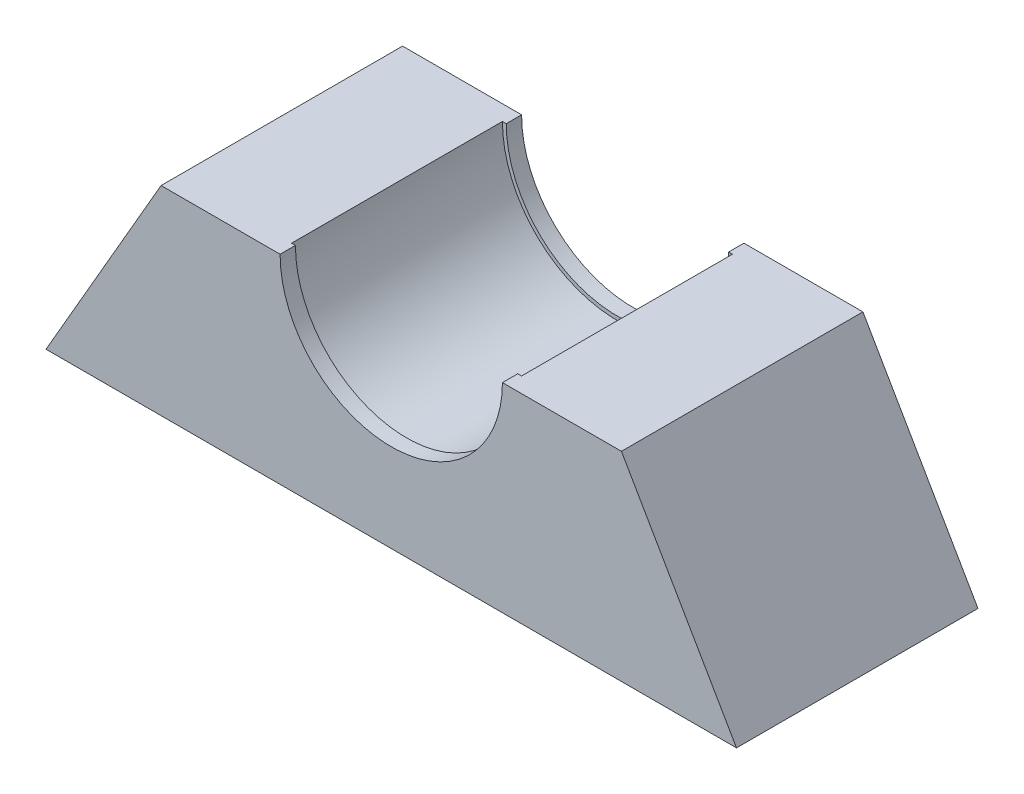
ISO-10303-21;
HEADER;
FILE_DESCRIPTION(('STEP AP214'),'2;1');
FILE_NAME('part.step','',(''),(''),'','','');
FILE_SCHEMA(('AUTOMOTIVE_DESIGN { 1 0 10303 214 1 1 1 1 }'));
ENDSEC;
DATA;
#1=APPLICATION_CONTEXT('core data for automotive mechanical design processes');
#2=APPLICATION_PROTOCOL_DEFINITION('international standard','automotive_design',2000,#1);
#3=PRODUCT_CONTEXT('',#1,'mechanical');
#4=PRODUCT('Part','Part','',(#3));
#5=PRODUCT_RELATED_PRODUCT_CATEGORY('part','',(#4));
#6=PRODUCT_DEFINITION_FORMATION('','',#4);
#7=PRODUCT_DEFINITION_CONTEXT('part definition',#1,'design');
#8=PRODUCT_DEFINITION('design','',#6,#7);
#9=PRODUCT_DEFINITION_SHAPE('','',#8);
#10=(LENGTH_UNIT() NAMED_UNIT(*) SI_UNIT(.MILLI.,.METRE.));
#11=(NAMED_UNIT(*) PLANE_ANGLE_UNIT() SI_UNIT($,.RADIAN.));
#12=(NAMED_UNIT(*) SI_UNIT($,.STERADIAN.) SOLID_ANGLE_UNIT());
#13=UNCERTAINTY_MEASURE_WITH_UNIT(LENGTH_MEASURE(1.E-05),#10,'distance_accuracy_value','');
#14=(GEOMETRIC_REPRESENTATION_CONTEXT(3) GLOBAL_UNCERTAINTY_ASSIGNED_CONTEXT((#13)) GLOBAL_UNIT_ASSIGNED_CONTEXT((#10,
#11,#12)) REPRESENTATION_CONTEXT('',''));
#15=CARTESIAN_POINT('',(0.,0.,0.));
#16=DIRECTION('',(0.,0.,1.));
#17=DIRECTION('',(1.,0.,0.));
#18=AXIS2_PLACEMENT_3D('',#15,#16,#17);
#19=CARTESIAN_POINT('',(0.,0.,27.5));
#20=DIRECTION('',(0.,1.,0.));
#21=DIRECTION('',(0.,0.,1.));
#22=AXIS2_PLACEMENT_3D('',#19,#20,#21);
#23=PLANE('',#22);
#24=DIRECTION('',(0.,0.,-1.));
#25=VECTOR('',#24,1.);
#26=CARTESIAN_POINT('',(30.0222139978605,0.,27.5));
#27=LINE('',#26,#25);
#28=CARTESIAN_POINT('',(30.0222139978605,0.,29.5));
#29=VERTEX_POINT('',#28);
#30=CARTESIAN_POINT('',(30.0222139978605,0.,-2.));
#31=VERTEX_POINT('',#30);
#32=EDGE_CURVE('E181',#29,#31,#27,.T.);
#33=ORIENTED_EDGE('',*,*,#32,.T.);
#34=DIRECTION('',(1.,0.,0.));
#35=VECTOR('',#34,1.);
#36=CARTESIAN_POINT('',(0.,0.,-2.));
#37=LINE('',#36,#35);
#38=CARTESIAN_POINT('',(14.5,0.,-2.));
#39=VERTEX_POINT('',#38);
#40=EDGE_CURVE('E133',#39,#31,#37,.T.);
#41=ORIENTED_EDGE('',*,*,#40,.F.);
#42=DIRECTION('',(0.,0.,1.));
#43=VECTOR('',#42,1.);
#44=CARTESIAN_POINT('',(14.5,0.,-2.));
#45=LINE('',#44,#43);
#46=CARTESIAN_POINT('',(14.5,0.,0.));
#47=VERTEX_POINT('',#46);
#48=EDGE_CURVE('E129',#39,#47,#45,.T.);
#49=ORIENTED_EDGE('',*,*,#48,.T.);
#50=DIRECTION('',(1.,0.,0.));
#51=VECTOR('',#50,1.);
#52=CARTESIAN_POINT('',(0.,0.,0.));
#53=LINE('',#52,#51);
#54=CARTESIAN_POINT('',(15.,0.,0.));
#55=VERTEX_POINT('',#54);
#56=EDGE_CURVE('E119',#47,#55,#53,.T.);
#57=ORIENTED_EDGE('',*,*,#56,.T.);
#58=DIRECTION('',(0.,0.,-1.));
#59=VECTOR('',#58,1.);
#60=CARTESIAN_POINT('',(15.,0.,27.5));
#61=LINE('',#60,#59);
#62=CARTESIAN_POINT('',(15.,0.,27.5));
#63=VERTEX_POINT('',#62);
#64=EDGE_CURVE('E11',#63,#55,#61,.T.);
#65=ORIENTED_EDGE('',*,*,#64,.F.);
#66=DIRECTION('',(-1.,0.,0.));
#67=VECTOR('',#66,1.);
#68=CARTESIAN_POINT('',(0.,0.,27.5));
#69=LINE('',#68,#67);
#70=CARTESIAN_POINT('',(14.5,0.,27.5));
#71=VERTEX_POINT('',#70);
#72=EDGE_CURVE('E51',#63,#71,#69,.T.);
#73=ORIENTED_EDGE('',*,*,#72,.T.);
#74=DIRECTION('',(0.,0.,-1.));
#75=VECTOR('',#74,1.);
#76=CARTESIAN_POINT('',(14.5,0.,29.5));
#77=LINE('',#76,#75);
#78=CARTESIAN_POINT('',(14.5,0.,29.5));
#79=VERTEX_POINT('',#78);
#80=EDGE_CURVE('E174',#79,#71,#77,.T.);
#81=ORIENTED_EDGE('',*,*,#80,.F.);
#82=DIRECTION('',(-1.,0.,0.));
#83=VECTOR('',#82,1.);
#84=CARTESIAN_POINT('',(0.,0.,29.5));
#85=LINE('',#84,#83);
#86=EDGE_CURVE('E152',#29,#79,#85,.T.);
#87=ORIENTED_EDGE('',*,*,#86,.F.);
#88=EDGE_LOOP('',(#33,#41,#49,#57,#65,#73,#81,#87));
#89=FACE_BOUND('',#88,.T.);
#90=ADVANCED_FACE('F37',(#89),#23,.T.);
#91=CARTESIAN_POINT('',(0.,0.,27.5));
#92=DIRECTION('',(0.,0.,-1.));
#93=DIRECTION('',(-1.,0.,0.));
#94=AXIS2_PLACEMENT_3D('',#91,#92,#93);
#95=CYLINDRICAL_SURFACE('',#94,15.);
#96=CARTESIAN_POINT('',(0.,0.,0.));
#97=DIRECTION('',(0.,0.,1.));
#98=DIRECTION('',(1.,0.,0.));
#99=AXIS2_PLACEMENT_3D('',#96,#97,#98);
#100=CIRCLE('',#99,15.);
#101=CARTESIAN_POINT('',(-15.,0.,0.));
#102=VERTEX_POINT('',#101);
#103=EDGE_CURVE('E177',#102,#55,#100,.T.);
#104=ORIENTED_EDGE('',*,*,#103,.F.);
#105=DIRECTION('',(0.,0.,-1.));
#106=VECTOR('',#105,1.);
#107=CARTESIAN_POINT('',(-15.,0.,27.5));
#108=LINE('',#107,#106);
#109=CARTESIAN_POINT('',(-15.,0.,27.5));
#110=VERTEX_POINT('',#109);
#111=EDGE_CURVE('E45',#110,#102,#108,.T.);
#112=ORIENTED_EDGE('',*,*,#111,.F.);
#113=CARTESIAN_POINT('',(0.,0.,27.5));
#114=DIRECTION('',(0.,0.,1.));
#115=DIRECTION('',(1.,0.,0.));
#116=AXIS2_PLACEMENT_3D('',#113,#114,#115);
#117=CIRCLE('',#116,15.);
#118=EDGE_CURVE('E178',#110,#63,#117,.T.);
#119=ORIENTED_EDGE('',*,*,#118,.T.);
#120=ORIENTED_EDGE('',*,*,#64,.T.);
#121=EDGE_LOOP('',(#104,#112,#119,#120));
#122=FACE_BOUND('',#121,.T.);
#123=ADVANCED_FACE('F194',(#122),#95,.F.);
#124=CARTESIAN_POINT('',(0.,0.,27.5));
#125=DIRECTION('',(0.,-1.,0.));
#126=DIRECTION('',(1.,0.,0.));
#127=AXIS2_PLACEMENT_3D('',#124,#125,#126);
#128=PLANE('',#127);
#129=ORIENTED_EDGE('',*,*,#111,.T.);
#130=DIRECTION('',(1.,0.,0.));
#131=VECTOR('',#130,1.);
#132=CARTESIAN_POINT('',(0.,0.,0.));
#133=LINE('',#132,#131);
#134=CARTESIAN_POINT('',(-14.5,0.,0.));
#135=VERTEX_POINT('',#134);
#136=EDGE_CURVE('E125',#102,#135,#133,.T.);
#137=ORIENTED_EDGE('',*,*,#136,.T.);
#138=DIRECTION('',(0.,0.,1.));
#139=VECTOR('',#138,1.);
#140=CARTESIAN_POINT('',(-14.5,0.,-2.));
#141=LINE('',#140,#139);
#142=CARTESIAN_POINT('',(-14.5,0.,-2.));
#143=VERTEX_POINT('',#142);
#144=EDGE_CURVE('E122',#143,#135,#141,.T.);
#145=ORIENTED_EDGE('',*,*,#144,.F.);
#146=DIRECTION('',(1.,0.,0.));
#147=VECTOR('',#146,1.);
#148=CARTESIAN_POINT('',(0.,0.,-2.));
#149=LINE('',#148,#147);
#150=CARTESIAN_POINT('',(-30.0222139978605,0.,-2.));
#151=VERTEX_POINT('',#150);
#152=EDGE_CURVE('E109',#151,#143,#149,.T.);
#153=ORIENTED_EDGE('',*,*,#152,.F.);
#154=DIRECTION('',(0.,0.,-1.));
#155=VECTOR('',#154,1.);
#156=CARTESIAN_POINT('',(-30.0222139978605,0.,27.5));
#157=LINE('',#156,#155);
#158=CARTESIAN_POINT('',(-30.0222139978605,0.,29.5));
#159=VERTEX_POINT('',#158);
#160=EDGE_CURVE('E189',#159,#151,#157,.T.);
#161=ORIENTED_EDGE('',*,*,#160,.F.);
#162=DIRECTION('',(-1.,0.,0.));
#163=VECTOR('',#162,1.);
#164=CARTESIAN_POINT('',(0.,0.,29.5));
#165=LINE('',#164,#163);
#166=CARTESIAN_POINT('',(-14.5,0.,29.5));
#167=VERTEX_POINT('',#166);
#168=EDGE_CURVE('E158',#167,#159,#165,.T.);
#169=ORIENTED_EDGE('',*,*,#168,.F.);
#170=DIRECTION('',(0.,0.,-1.));
#171=VECTOR('',#170,1.);
#172=CARTESIAN_POINT('',(-14.5,0.,29.5));
#173=LINE('',#172,#171);
#174=CARTESIAN_POINT('',(-14.5,0.,27.5));
#175=VERTEX_POINT('',#174);
#176=EDGE_CURVE('E167',#167,#175,#173,.T.);
#177=ORIENTED_EDGE('',*,*,#176,.T.);
#178=DIRECTION('',(-1.,0.,0.));
#179=VECTOR('',#178,1.);
#180=CARTESIAN_POINT('',(0.,0.,27.5));
#181=LINE('',#180,#179);
#182=EDGE_CURVE('E153',#175,#110,#181,.T.);
#183=ORIENTED_EDGE('',*,*,#182,.T.);
#184=EDGE_LOOP('',(#129,#137,#145,#153,#161,#169,#177,#183));
#185=FACE_BOUND('',#184,.T.);
#186=ADVANCED_FACE('F123',(#185),#128,.F.);
#187=CARTESIAN_POINT('',(-22.5166604983954,13.,27.5));
#188=DIRECTION('',(0.866025403784439,-0.5,0.));
#189=DIRECTION('',(0.5,0.866025403784439,0.));
#190=AXIS2_PLACEMENT_3D('',#187,#188,#189);
#191=PLANE('',#190);
#192=ORIENTED_EDGE('',*,*,#160,.T.);
#193=DIRECTION('',(0.5,0.866025403784439,0.));
#194=VECTOR('',#193,1.);
#195=CARTESIAN_POINT('',(-22.5166604983954,13.,-2.));
#196=LINE('',#195,#194);
#197=CARTESIAN_POINT('',(-45.0333209967908,-26.,-2.));
#198=VERTEX_POINT('',#197);
#199=EDGE_CURVE('E117',#198,#151,#196,.T.);
#200=ORIENTED_EDGE('',*,*,#199,.F.);
#201=DIRECTION('',(0.,0.,-1.));
#202=VECTOR('',#201,1.);
#203=CARTESIAN_POINT('',(-45.0333209967908,-26.,27.5));
#204=LINE('',#203,#202);
#205=CARTESIAN_POINT('',(-45.0333209967908,-26.,29.5));
#206=VERTEX_POINT('',#205);
#207=EDGE_CURVE('E187',#206,#198,#204,.T.);
#208=ORIENTED_EDGE('',*,*,#207,.F.);
#209=DIRECTION('',(-0.5,-0.866025403784439,0.));
#210=VECTOR('',#209,1.);
#211=CARTESIAN_POINT('',(-22.5166604983954,13.,29.5));
#212=LINE('',#211,#210);
#213=EDGE_CURVE('E161',#159,#206,#212,.T.);
#214=ORIENTED_EDGE('',*,*,#213,.F.);
#215=EDGE_LOOP('',(#192,#200,#208,#214));
#216=FACE_BOUND('',#215,.T.);
#217=ADVANCED_FACE('F214',(#216),#191,.F.);
#218=CARTESIAN_POINT('',(0.,-26.,27.5));
#219=DIRECTION('',(0.,1.,0.));
#220=DIRECTION('',(0.,0.,1.));
#221=AXIS2_PLACEMENT_3D('',#218,#219,#220);
#222=PLANE('',#221);
#223=ORIENTED_EDGE('',*,*,#207,.T.);
#224=DIRECTION('',(-1.,0.,0.));
#225=VECTOR('',#224,1.);
#226=CARTESIAN_POINT('',(0.,-26.,-2.));
#227=LINE('',#226,#225);
#228=CARTESIAN_POINT('',(45.0333209967908,-26.,-2.));
#229=VERTEX_POINT('',#228);
#230=EDGE_CURVE('E140',#229,#198,#227,.T.);
#231=ORIENTED_EDGE('',*,*,#230,.F.);
#232=DIRECTION('',(0.,0.,-1.));
#233=VECTOR('',#232,1.);
#234=CARTESIAN_POINT('',(45.0333209967908,-26.,27.5));
#235=LINE('',#234,#233);
#236=CARTESIAN_POINT('',(45.0333209967908,-26.,29.5));
#237=VERTEX_POINT('',#236);
#238=EDGE_CURVE('E185',#237,#229,#235,.T.);
#239=ORIENTED_EDGE('',*,*,#238,.F.);
#240=DIRECTION('',(1.,0.,0.));
#241=VECTOR('',#240,1.);
#242=CARTESIAN_POINT('',(0.,-26.,29.5));
#243=LINE('',#242,#241);
#244=EDGE_CURVE('E164',#206,#237,#243,.T.);
#245=ORIENTED_EDGE('',*,*,#244,.F.);
#246=EDGE_LOOP('',(#223,#231,#239,#245));
#247=FACE_BOUND('',#246,.T.);
#248=ADVANCED_FACE('F207',(#247),#222,.F.);
#249=CARTESIAN_POINT('',(22.5166604983954,13.,27.5));
#250=DIRECTION('',(-0.866025403784438,-0.5,0.));
#251=DIRECTION('',(0.5,-0.866025403784439,0.));
#252=AXIS2_PLACEMENT_3D('',#249,#250,#251);
#253=PLANE('',#252);
#254=ORIENTED_EDGE('',*,*,#238,.T.);
#255=DIRECTION('',(0.5,-0.866025403784439,0.));
#256=VECTOR('',#255,1.);
#257=CARTESIAN_POINT('',(22.5166604983954,13.,-2.));
#258=LINE('',#257,#256);
#259=EDGE_CURVE('E135',#31,#229,#258,.T.);
#260=ORIENTED_EDGE('',*,*,#259,.F.);
#261=ORIENTED_EDGE('',*,*,#32,.F.);
#262=DIRECTION('',(-0.5,0.866025403784439,0.));
#263=VECTOR('',#262,1.);
#264=CARTESIAN_POINT('',(22.5166604983954,13.,29.5));
#265=LINE('',#264,#263);
#266=EDGE_CURVE('E149',#237,#29,#265,.T.);
#267=ORIENTED_EDGE('',*,*,#266,.F.);
#268=EDGE_LOOP('',(#254,#260,#261,#267));
#269=FACE_BOUND('',#268,.T.);
#270=ADVANCED_FACE('F203',(#269),#253,.F.);
#271=CARTESIAN_POINT('',(0.,0.,27.5));
#272=DIRECTION('',(0.,0.,1.));
#273=DIRECTION('',(1.,0.,0.));
#274=AXIS2_PLACEMENT_3D('',#271,#272,#273);
#275=PLANE('',#274);
#276=ORIENTED_EDGE('',*,*,#118,.F.);
#277=ORIENTED_EDGE('',*,*,#182,.F.);
#278=CARTESIAN_POINT('',(0.,0.,27.5));
#279=DIRECTION('',(0.,0.,1.));
#280=DIRECTION('',(1.,0.,0.));
#281=AXIS2_PLACEMENT_3D('',#278,#279,#280);
#282=CIRCLE('',#281,14.5);
#283=EDGE_CURVE('E169',#175,#71,#282,.T.);
#284=ORIENTED_EDGE('',*,*,#283,.T.);
#285=ORIENTED_EDGE('',*,*,#72,.F.);
#286=EDGE_LOOP('',(#276,#277,#284,#285));
#287=FACE_BOUND('',#286,.T.);
#288=ADVANCED_FACE('F219',(#287),#275,.F.);
#289=CARTESIAN_POINT('',(0.,0.,29.5));
#290=DIRECTION('',(0.,0.,-1.));
#291=DIRECTION('',(-1.,0.,0.));
#292=AXIS2_PLACEMENT_3D('',#289,#290,#291);
#293=CYLINDRICAL_SURFACE('',#292,14.5);
#294=ORIENTED_EDGE('',*,*,#283,.F.);
#295=ORIENTED_EDGE('',*,*,#176,.F.);
#296=CARTESIAN_POINT('',(0.,0.,29.5));
#297=DIRECTION('',(0.,0.,1.));
#298=DIRECTION('',(1.,0.,0.));
#299=AXIS2_PLACEMENT_3D('',#296,#297,#298);
#300=CIRCLE('',#299,14.5);
#301=EDGE_CURVE('E155',#167,#79,#300,.T.);
#302=ORIENTED_EDGE('',*,*,#301,.T.);
#303=ORIENTED_EDGE('',*,*,#80,.T.);
#304=EDGE_LOOP('',(#294,#295,#302,#303));
#305=FACE_BOUND('',#304,.T.);
#306=ADVANCED_FACE('F218',(#305),#293,.F.);
#307=CARTESIAN_POINT('',(0.,0.,29.5));
#308=DIRECTION('',(0.,0.,1.));
#309=DIRECTION('',(1.,0.,0.));
#310=AXIS2_PLACEMENT_3D('',#307,#308,#309);
#311=PLANE('',#310);
#312=ORIENTED_EDGE('',*,*,#266,.T.);
#313=ORIENTED_EDGE('',*,*,#86,.T.);
#314=ORIENTED_EDGE('',*,*,#301,.F.);
#315=ORIENTED_EDGE('',*,*,#168,.T.);
#316=ORIENTED_EDGE('',*,*,#213,.T.);
#317=ORIENTED_EDGE('',*,*,#244,.T.);
#318=EDGE_LOOP('',(#312,#313,#314,#315,#316,#317));
#319=FACE_BOUND('',#318,.T.);
#320=ADVANCED_FACE('F209',(#319),#311,.T.);
#321=CARTESIAN_POINT('',(0.,0.,0.));
#322=DIRECTION('',(0.,0.,-1.));
#323=DIRECTION('',(-1.,0.,0.));
#324=AXIS2_PLACEMENT_3D('',#321,#322,#323);
#325=PLANE('',#324);
#326=ORIENTED_EDGE('',*,*,#136,.F.);
#327=ORIENTED_EDGE('',*,*,#103,.T.);
#328=ORIENTED_EDGE('',*,*,#56,.F.);
#329=CARTESIAN_POINT('',(0.,0.,0.));
#330=DIRECTION('',(0.,0.,-1.));
#331=DIRECTION('',(-1.,0.,0.));
#332=AXIS2_PLACEMENT_3D('',#329,#330,#331);
#333=CIRCLE('',#332,14.5);
#334=EDGE_CURVE('E144',#47,#135,#333,.T.);
#335=ORIENTED_EDGE('',*,*,#334,.T.);
#336=EDGE_LOOP('',(#326,#327,#328,#335));
#337=FACE_BOUND('',#336,.T.);
#338=ADVANCED_FACE('F197',(#337),#325,.F.);
#339=CARTESIAN_POINT('',(0.,0.,-2.));
#340=DIRECTION('',(0.,0.,1.));
#341=DIRECTION('',(1.,0.,0.));
#342=AXIS2_PLACEMENT_3D('',#339,#340,#341);
#343=CYLINDRICAL_SURFACE('',#342,14.5);
#344=ORIENTED_EDGE('',*,*,#334,.F.);
#345=ORIENTED_EDGE('',*,*,#48,.F.);
#346=CARTESIAN_POINT('',(0.,0.,-2.));
#347=DIRECTION('',(0.,0.,-1.));
#348=DIRECTION('',(-1.,0.,0.));
#349=AXIS2_PLACEMENT_3D('',#346,#347,#348);
#350=CIRCLE('',#349,14.5);
#351=EDGE_CURVE('E114',#39,#143,#350,.T.);
#352=ORIENTED_EDGE('',*,*,#351,.T.);
#353=ORIENTED_EDGE('',*,*,#144,.T.);
#354=EDGE_LOOP('',(#344,#345,#352,#353));
#355=FACE_BOUND('',#354,.T.);
#356=ADVANCED_FACE('F131',(#355),#343,.F.);
#357=CARTESIAN_POINT('',(0.,0.,-2.));
#358=DIRECTION('',(0.,0.,-1.));
#359=DIRECTION('',(-1.,0.,0.));
#360=AXIS2_PLACEMENT_3D('',#357,#358,#359);
#361=PLANE('',#360);
#362=ORIENTED_EDGE('',*,*,#152,.T.);
#363=ORIENTED_EDGE('',*,*,#351,.F.);
#364=ORIENTED_EDGE('',*,*,#40,.T.);
#365=ORIENTED_EDGE('',*,*,#259,.T.);
#366=ORIENTED_EDGE('',*,*,#230,.T.);
#367=ORIENTED_EDGE('',*,*,#199,.T.);
#368=EDGE_LOOP('',(#362,#363,#364,#365,#366,#367));
#369=FACE_BOUND('',#368,.T.);
#370=ADVANCED_FACE('F111',(#369),#361,.T.);
#371=CLOSED_SHELL('',(#90,#123,#186,#217,#248,#270,#288,#306,#320,#338,#356,#370));
#372=MANIFOLD_SOLID_BREP('B2',#371);
#373=ADVANCED_BREP_SHAPE_REPRESENTATION('',(#18,#372),#14);
#374=SHAPE_DEFINITION_REPRESENTATION(#9,#373);
ENDSEC;
END-ISO-10303-21;
